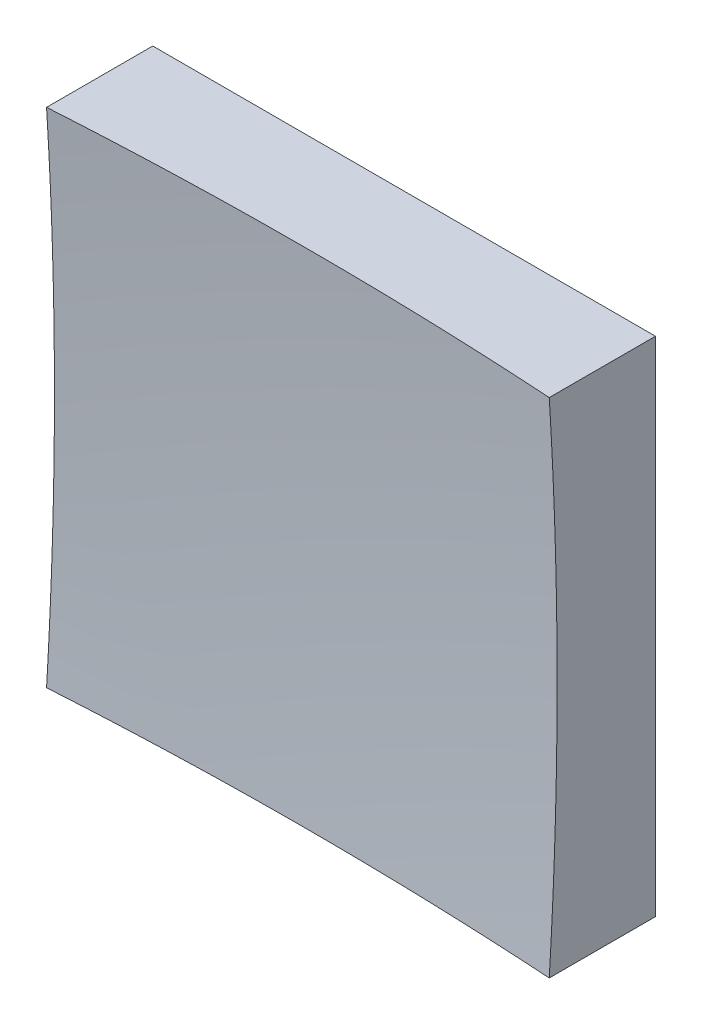
ISO-10303-21;
HEADER;
FILE_DESCRIPTION(('STEP AP214'),'2;1');
FILE_NAME('part.step','',(''),(''),'','','');
FILE_SCHEMA(('AUTOMOTIVE_DESIGN { 1 0 10303 214 1 1 1 1 }'));
ENDSEC;
DATA;
#1=APPLICATION_CONTEXT('core data for automotive mechanical design processes');
#2=APPLICATION_PROTOCOL_DEFINITION('international standard','automotive_design',2000,#1);
#3=PRODUCT_CONTEXT('',#1,'mechanical');
#4=PRODUCT('Part','Part','',(#3));
#5=PRODUCT_RELATED_PRODUCT_CATEGORY('part','',(#4));
#6=PRODUCT_DEFINITION_FORMATION('','',#4);
#7=PRODUCT_DEFINITION_CONTEXT('part definition',#1,'design');
#8=PRODUCT_DEFINITION('design','',#6,#7);
#9=PRODUCT_DEFINITION_SHAPE('','',#8);
#10=(LENGTH_UNIT() NAMED_UNIT(*) SI_UNIT(.MILLI.,.METRE.));
#11=(NAMED_UNIT(*) PLANE_ANGLE_UNIT() SI_UNIT($,.RADIAN.));
#12=(NAMED_UNIT(*) SI_UNIT($,.STERADIAN.) SOLID_ANGLE_UNIT());
#13=UNCERTAINTY_MEASURE_WITH_UNIT(LENGTH_MEASURE(1.E-05),#10,'distance_accuracy_value','');
#14=(GEOMETRIC_REPRESENTATION_CONTEXT(3) GLOBAL_UNCERTAINTY_ASSIGNED_CONTEXT((#13)) GLOBAL_UNIT_ASSIGNED_CONTEXT((#10,
#11,#12)) REPRESENTATION_CONTEXT('',''));
#15=CARTESIAN_POINT('',(0.,0.,0.));
#16=DIRECTION('',(0.,0.,1.));
#17=DIRECTION('',(1.,0.,0.));
#18=AXIS2_PLACEMENT_3D('',#15,#16,#17);
#19=CARTESIAN_POINT('',(-25.,25.,50.));
#20=DIRECTION('',(0.,1.,0.));
#21=DIRECTION('',(0.,0.,1.));
#22=AXIS2_PLACEMENT_3D('',#19,#20,#21);
#23=PLANE('',#22);
#24=CARTESIAN_POINT('',(0.,25.,409.));
#25=DIRECTION('',(0.,1.,0.));
#26=DIRECTION('',(0.,0.,1.));
#27=AXIS2_PLACEMENT_3D('',#24,#25,#26);
#28=CIRCLE('',#27,399.217985566783);
#29=CARTESIAN_POINT('',(25.,25.,10.5655637372694));
#30=VERTEX_POINT('',#29);
#31=CARTESIAN_POINT('',(-25.,25.,10.5655637372694));
#32=VERTEX_POINT('',#31);
#33=EDGE_CURVE('E79',#30,#32,#28,.T.);
#34=ORIENTED_EDGE('',*,*,#33,.F.);
#35=DIRECTION('',(0.,0.,-1.));
#36=VECTOR('',#35,1.);
#37=CARTESIAN_POINT('',(25.,25.,50.));
#38=LINE('',#37,#36);
#39=CARTESIAN_POINT('',(25.,25.,0.));
#40=VERTEX_POINT('',#39);
#41=EDGE_CURVE('E85',#30,#40,#38,.T.);
#42=ORIENTED_EDGE('',*,*,#41,.T.);
#43=DIRECTION('',(1.,0.,0.));
#44=VECTOR('',#43,1.);
#45=CARTESIAN_POINT('',(-25.,25.,0.));
#46=LINE('',#45,#44);
#47=CARTESIAN_POINT('',(-25.,25.,0.));
#48=VERTEX_POINT('',#47);
#49=EDGE_CURVE('E88',#48,#40,#46,.T.);
#50=ORIENTED_EDGE('',*,*,#49,.F.);
#51=DIRECTION('',(0.,0.,-1.));
#52=VECTOR('',#51,1.);
#53=CARTESIAN_POINT('',(-25.,25.,50.));
#54=LINE('',#53,#52);
#55=EDGE_CURVE('E47',#32,#48,#54,.T.);
#56=ORIENTED_EDGE('',*,*,#55,.F.);
#57=EDGE_LOOP('',(#34,#42,#50,#56));
#58=FACE_BOUND('',#57,.T.);
#59=ADVANCED_FACE('F39',(#58),#23,.T.);
#60=CARTESIAN_POINT('',(-25.,25.,50.));
#61=DIRECTION('',(1.,0.,0.));
#62=DIRECTION('',(0.,1.,0.));
#63=AXIS2_PLACEMENT_3D('',#60,#61,#62);
#64=PLANE('',#63);
#65=DIRECTION('',(0.,0.,-1.));
#66=VECTOR('',#65,1.);
#67=CARTESIAN_POINT('',(-25.,-25.,50.));
#68=LINE('',#67,#66);
#69=CARTESIAN_POINT('',(-25.,-25.,10.5655637372694));
#70=VERTEX_POINT('',#69);
#71=CARTESIAN_POINT('',(-25.,-25.,0.));
#72=VERTEX_POINT('',#71);
#73=EDGE_CURVE('E100',#70,#72,#68,.T.);
#74=ORIENTED_EDGE('',*,*,#73,.F.);
#75=CARTESIAN_POINT('',(-25.,0.,409.));
#76=DIRECTION('',(1.,0.,0.));
#77=DIRECTION('',(0.,1.,0.));
#78=AXIS2_PLACEMENT_3D('',#75,#76,#77);
#79=CIRCLE('',#78,399.217985566783);
#80=EDGE_CURVE('E89',#70,#32,#79,.T.);
#81=ORIENTED_EDGE('',*,*,#80,.T.);
#82=ORIENTED_EDGE('',*,*,#55,.T.);
#83=DIRECTION('',(0.,-1.,0.));
#84=VECTOR('',#83,1.);
#85=CARTESIAN_POINT('',(-25.,25.,0.));
#86=LINE('',#85,#84);
#87=EDGE_CURVE('E97',#48,#72,#86,.T.);
#88=ORIENTED_EDGE('',*,*,#87,.T.);
#89=EDGE_LOOP('',(#74,#81,#82,#88));
#90=FACE_BOUND('',#89,.T.);
#91=ADVANCED_FACE('F122',(#90),#64,.F.);
#92=CARTESIAN_POINT('',(-25.,-25.,50.));
#93=DIRECTION('',(0.,1.,0.));
#94=DIRECTION('',(0.,0.,1.));
#95=AXIS2_PLACEMENT_3D('',#92,#93,#94);
#96=PLANE('',#95);
#97=DIRECTION('',(0.,0.,-1.));
#98=VECTOR('',#97,1.);
#99=CARTESIAN_POINT('',(25.,-25.,50.));
#100=LINE('',#99,#98);
#101=CARTESIAN_POINT('',(25.,-25.,10.5655637372694));
#102=VERTEX_POINT('',#101);
#103=CARTESIAN_POINT('',(25.,-25.,0.));
#104=VERTEX_POINT('',#103);
#105=EDGE_CURVE('E96',#102,#104,#100,.T.);
#106=ORIENTED_EDGE('',*,*,#105,.F.);
#107=CARTESIAN_POINT('',(0.,-25.,409.));
#108=DIRECTION('',(0.,1.,0.));
#109=DIRECTION('',(0.,0.,1.));
#110=AXIS2_PLACEMENT_3D('',#107,#108,#109);
#111=CIRCLE('',#110,399.217985566783);
#112=EDGE_CURVE('E53',#102,#70,#111,.T.);
#113=ORIENTED_EDGE('',*,*,#112,.T.);
#114=ORIENTED_EDGE('',*,*,#73,.T.);
#115=DIRECTION('',(1.,0.,0.));
#116=VECTOR('',#115,1.);
#117=CARTESIAN_POINT('',(-25.,-25.,0.));
#118=LINE('',#117,#116);
#119=EDGE_CURVE('E102',#72,#104,#118,.T.);
#120=ORIENTED_EDGE('',*,*,#119,.T.);
#121=EDGE_LOOP('',(#106,#113,#114,#120));
#122=FACE_BOUND('',#121,.T.);
#123=ADVANCED_FACE('F121',(#122),#96,.F.);
#124=CARTESIAN_POINT('',(25.,25.,50.));
#125=DIRECTION('',(1.,0.,0.));
#126=DIRECTION('',(0.,1.,0.));
#127=AXIS2_PLACEMENT_3D('',#124,#125,#126);
#128=PLANE('',#127);
#129=CARTESIAN_POINT('',(25.,0.,409.));
#130=DIRECTION('',(1.,0.,0.));
#131=DIRECTION('',(0.,1.,0.));
#132=AXIS2_PLACEMENT_3D('',#129,#130,#131);
#133=CIRCLE('',#132,399.217985566783);
#134=EDGE_CURVE('E11',#102,#30,#133,.T.);
#135=ORIENTED_EDGE('',*,*,#134,.F.);
#136=ORIENTED_EDGE('',*,*,#105,.T.);
#137=DIRECTION('',(0.,-1.,0.));
#138=VECTOR('',#137,1.);
#139=CARTESIAN_POINT('',(25.,25.,0.));
#140=LINE('',#139,#138);
#141=EDGE_CURVE('E93',#40,#104,#140,.T.);
#142=ORIENTED_EDGE('',*,*,#141,.F.);
#143=ORIENTED_EDGE('',*,*,#41,.F.);
#144=EDGE_LOOP('',(#135,#136,#142,#143));
#145=FACE_BOUND('',#144,.T.);
#146=ADVANCED_FACE('F91',(#145),#128,.T.);
#147=CARTESIAN_POINT('',(0.,0.,0.));
#148=DIRECTION('',(0.,0.,-1.));
#149=DIRECTION('',(-1.,0.,0.));
#150=AXIS2_PLACEMENT_3D('',#147,#148,#149);
#151=PLANE('',#150);
#152=ORIENTED_EDGE('',*,*,#49,.T.);
#153=ORIENTED_EDGE('',*,*,#141,.T.);
#154=ORIENTED_EDGE('',*,*,#119,.F.);
#155=ORIENTED_EDGE('',*,*,#87,.F.);
#156=EDGE_LOOP('',(#152,#153,#154,#155));
#157=FACE_BOUND('',#156,.T.);
#158=ADVANCED_FACE('F125',(#157),#151,.T.);
#159=CARTESIAN_POINT('',(0.,0.,409.));
#160=DIRECTION('',(0.,0.,1.));
#161=DIRECTION('',(1.,0.,0.));
#162=AXIS2_PLACEMENT_3D('',#159,#160,#161);
#163=SPHERICAL_SURFACE('',#162,400.);
#164=ORIENTED_EDGE('',*,*,#33,.T.);
#165=ORIENTED_EDGE('',*,*,#80,.F.);
#166=ORIENTED_EDGE('',*,*,#112,.F.);
#167=ORIENTED_EDGE('',*,*,#134,.T.);
#168=EDGE_LOOP('',(#164,#165,#166,#167));
#169=FACE_BOUND('',#168,.T.);
#170=ADVANCED_FACE('F78',(#169),#163,.F.);
#171=CLOSED_SHELL('',(#59,#91,#123,#146,#158,#170));
#172=MANIFOLD_SOLID_BREP('B2',#171);
#173=ADVANCED_BREP_SHAPE_REPRESENTATION('',(#18,#172),#14);
#174=SHAPE_DEFINITION_REPRESENTATION(#9,#173);
ENDSEC;
END-ISO-10303-21;
